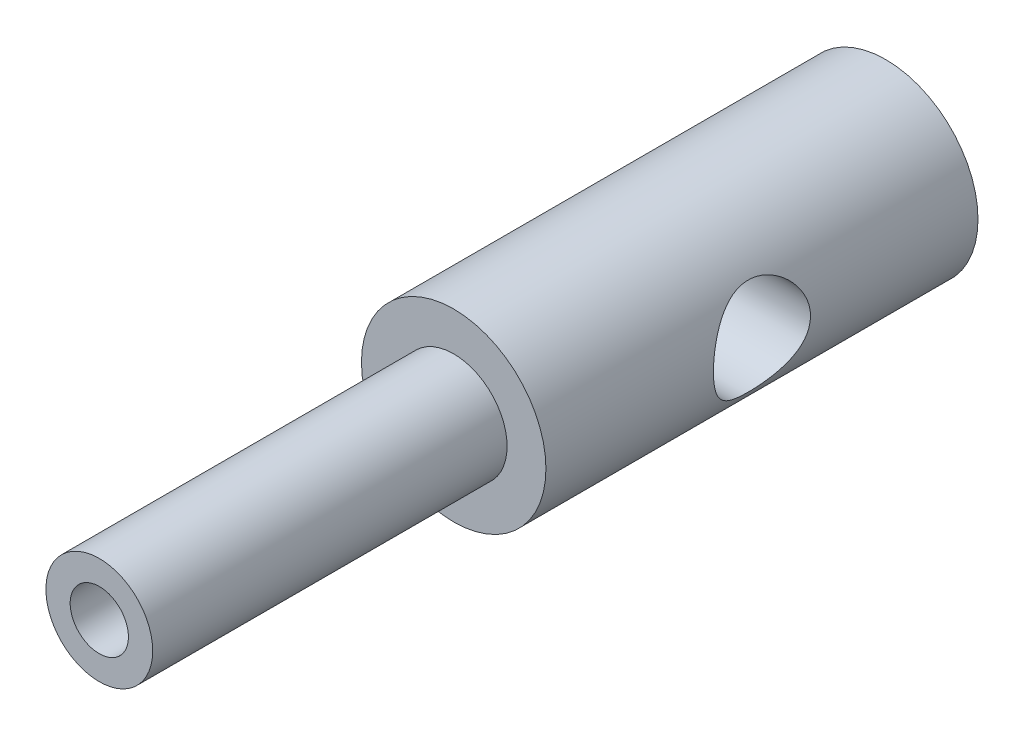
ISO-10303-21;
HEADER;
FILE_DESCRIPTION(('STEP AP214'),'2;1');
FILE_NAME('part.step','',(''),(''),'','','');
FILE_SCHEMA(('AUTOMOTIVE_DESIGN { 1 0 10303 214 1 1 1 1 }'));
ENDSEC;
DATA;
#1=APPLICATION_CONTEXT('core data for automotive mechanical design processes');
#2=APPLICATION_PROTOCOL_DEFINITION('international standard','automotive_design',2000,#1);
#3=PRODUCT_CONTEXT('',#1,'mechanical');
#4=PRODUCT('Part','Part','',(#3));
#5=PRODUCT_RELATED_PRODUCT_CATEGORY('part','',(#4));
#6=PRODUCT_DEFINITION_FORMATION('','',#4);
#7=PRODUCT_DEFINITION_CONTEXT('part definition',#1,'design');
#8=PRODUCT_DEFINITION('design','',#6,#7);
#9=PRODUCT_DEFINITION_SHAPE('','',#8);
#10=(LENGTH_UNIT() NAMED_UNIT(*) SI_UNIT(.MILLI.,.METRE.));
#11=(NAMED_UNIT(*) PLANE_ANGLE_UNIT() SI_UNIT($,.RADIAN.));
#12=(NAMED_UNIT(*) SI_UNIT($,.STERADIAN.) SOLID_ANGLE_UNIT());
#13=UNCERTAINTY_MEASURE_WITH_UNIT(LENGTH_MEASURE(1.E-05),#10,'distance_accuracy_value','');
#14=(GEOMETRIC_REPRESENTATION_CONTEXT(3) GLOBAL_UNCERTAINTY_ASSIGNED_CONTEXT((#13)) GLOBAL_UNIT_ASSIGNED_CONTEXT((#10,
#11,#12)) REPRESENTATION_CONTEXT('',''));
#15=CARTESIAN_POINT('',(0.,0.,0.));
#16=DIRECTION('',(0.,0.,1.));
#17=DIRECTION('',(1.,0.,0.));
#18=AXIS2_PLACEMENT_3D('',#15,#16,#17);
#19=CARTESIAN_POINT('',(0.,0.,36.6134723107493));
#20=DIRECTION('',(0.,0.,1.));
#21=DIRECTION('',(1.,0.,0.));
#22=AXIS2_PLACEMENT_3D('',#19,#20,#21);
#23=CYLINDRICAL_SURFACE('',#22,1.524);
#24=CARTESIAN_POINT('',(0.,0.,11.303));
#25=DIRECTION('',(0.,0.,1.));
#26=DIRECTION('',(1.,0.,0.));
#27=AXIS2_PLACEMENT_3D('',#24,#25,#26);
#28=CIRCLE('',#27,1.524);
#29=CARTESIAN_POINT('',(1.524,0.,11.303));
#30=VERTEX_POINT('',#29);
#31=EDGE_CURVE('E11',#30,#30,#28,.T.);
#32=ORIENTED_EDGE('',*,*,#31,.F.);
#33=EDGE_LOOP('',(#32));
#34=FACE_BOUND('',#33,.T.);
#35=CARTESIAN_POINT('',(0.,0.,29.845));
#36=DIRECTION('',(0.,0.,1.));
#37=DIRECTION('',(1.,0.,0.));
#38=AXIS2_PLACEMENT_3D('',#35,#36,#37);
#39=CIRCLE('',#38,1.524);
#40=CARTESIAN_POINT('',(1.524,0.,29.845));
#41=VERTEX_POINT('',#40);
#42=EDGE_CURVE('E64',#41,#41,#39,.T.);
#43=ORIENTED_EDGE('',*,*,#42,.T.);
#44=EDGE_LOOP('',(#43));
#45=FACE_BOUND('',#44,.T.);
#46=ADVANCED_FACE('F32',(#34,#45),#23,.F.);
#47=CARTESIAN_POINT('',(0.,1.524,11.303));
#48=DIRECTION('',(0.,0.,-1.));
#49=DIRECTION('',(-1.,0.,0.));
#50=AXIS2_PLACEMENT_3D('',#47,#48,#49);
#51=PLANE('',#50);
#52=ORIENTED_EDGE('',*,*,#31,.T.);
#53=EDGE_LOOP('',(#52));
#54=FACE_BOUND('',#53,.T.);
#55=ADVANCED_FACE('F44',(#54),#51,.F.);
#56=CARTESIAN_POINT('',(0.210398319920231,0.,-1.34864201962109));
#57=DIRECTION('',(0.,-1.,0.));
#58=DIRECTION('',(1.,0.,0.));
#59=AXIS2_PLACEMENT_3D('',#56,#57,#58);
#60=CIRCLE('',#59,10.9723753887063);
#61=TRIMMED_CURVE('',#60,(PARAMETER_VALUE(-1.58997277749052)),
(PARAMETER_VALUE(1.58997277749052)),.T.,.PARAMETER.);
#62=CARTESIAN_POINT('',(0.,0.,-1.34864201962109));
#63=DIRECTION('',(0.,0.,1.));
#64=AXIS1_PLACEMENT('',#62,#63);
#65=SURFACE_OF_REVOLUTION('',#61,#64);
#66=CARTESIAN_POINT('',(0.,0.,-11.303));
#67=DIRECTION('',(0.,0.,1.));
#68=DIRECTION('',(1.,0.,0.));
#69=AXIS2_PLACEMENT_3D('',#66,#67,#68);
#70=CIRCLE('',#69,4.826);
#71=CARTESIAN_POINT('',(4.826,0.,-11.303));
#72=VERTEX_POINT('',#71);
#73=EDGE_CURVE('E38',#72,#72,#70,.T.);
#74=ORIENTED_EDGE('',*,*,#73,.F.);
#75=EDGE_LOOP('',(#74));
#76=FACE_BOUND('',#75,.T.);
#77=CARTESIAN_POINT('',(0.,0.,-12.319));
#78=VERTEX_POINT('',#77);
#79=VERTEX_LOOP('',#78);
#80=FACE_BOUND('',#79,.T.);
#81=ADVANCED_FACE('F41',(#76,#80),#65,.T.);
#82=CARTESIAN_POINT('',(0.,0.,36.6134723107493));
#83=DIRECTION('',(0.,0.,1.));
#84=DIRECTION('',(1.,0.,0.));
#85=AXIS2_PLACEMENT_3D('',#82,#83,#84);
#86=CYLINDRICAL_SURFACE('',#85,4.826);
#87=CARTESIAN_POINT('',(-4.826,0.,-2.54));
#88=CARTESIAN_POINT('',(-4.82599108722361,0.132671727413436,-2.53998970239344));
#89=CARTESIAN_POINT('',(-4.82047125156288,0.265481968353217,-2.52954357726874));
#90=CARTESIAN_POINT('',(-4.79893032203788,0.527119821613084,-2.48824304450853));
#91=CARTESIAN_POINT('',(-4.78289216641369,0.655940606494487,-2.45735547808212));
#92=CARTESIAN_POINT('',(-4.7419816922442,0.905431289774782,-2.37674403171466));
#93=CARTESIAN_POINT('',(-4.71714487204603,1.02613165516498,-2.32709578912966));
#94=CARTESIAN_POINT('',(-4.66086863610746,1.25727953018631,-2.21079285628327));
#95=CARTESIAN_POINT('',(-4.62942930184638,1.36772716631853,-2.14413837588774));
#96=CARTESIAN_POINT('',(-4.56038023318126,1.5832989798215,-1.99082406976726));
#97=CARTESIAN_POINT('',(-4.52250238950114,1.68761176994581,-1.90314624917141));
#98=CARTESIAN_POINT('',(-4.44563295884892,1.88081258984201,-1.71247923080912));
#99=CARTESIAN_POINT('',(-4.4066404564786,1.96968749142896,-1.60947713830809));
#100=CARTESIAN_POINT('',(-4.32795611021071,2.1373780367139,-1.38026510829494));
#101=CARTESIAN_POINT('',(-4.28850606243428,2.21461446655133,-1.25280939787052));
#102=CARTESIAN_POINT('',(-4.2179379601073,2.34625321505091,-0.984350884530217));
#103=CARTESIAN_POINT('',(-4.18681355758633,2.40067294859597,-0.843358514883821));
#104=CARTESIAN_POINT('',(-4.15092654717635,2.46182491483836,-0.629364435915659));
#105=CARTESIAN_POINT('',(-4.14093754389936,2.47854123230209,-0.559963251692714));
#106=CARTESIAN_POINT('',(-4.1243090393974,2.50611551780559,-0.41962701740498));
#107=CARTESIAN_POINT('',(-4.11766766376968,2.51697676445226,-0.348692848945094));
#108=CARTESIAN_POINT('',(-4.10804505946568,2.53265234988395,-0.205965434651406));
#109=CARTESIAN_POINT('',(-4.1050610127179,2.53747134445475,-0.134172893344674));
#110=CARTESIAN_POINT('',(-4.10287559704393,2.54100092747068,0.00959608356973793));
#111=CARTESIAN_POINT('',(-4.10367379235338,2.539712219604,0.0815724970379407));
#112=CARTESIAN_POINT('',(-4.11099346238332,2.52787067626693,0.277161496402171));
#113=CARTESIAN_POINT('',(-4.12124856777439,2.51127256309405,0.400333711927561));
#114=CARTESIAN_POINT('',(-4.15163246424047,2.46070324540304,0.641710718396217));
#115=CARTESIAN_POINT('',(-4.1717650305969,2.42672539793513,0.759913591228928));
#116=CARTESIAN_POINT('',(-4.22001621717023,2.34182911069649,0.991456040571426));
#117=CARTESIAN_POINT('',(-4.24830604698801,2.29054297408753,1.10462387686321));
#118=CARTESIAN_POINT('',(-4.30972258399316,2.17277977330617,1.32130894809646));
#119=CARTESIAN_POINT('',(-4.34285144686724,2.10629593138129,1.42482184811691));
#120=CARTESIAN_POINT('',(-4.41590404440184,1.94900130669127,1.63479698245392));
#121=CARTESIAN_POINT('',(-4.45612325057126,1.85607382057027,1.73957678842223));
#122=CARTESIAN_POINT('',(-4.53504609144926,1.65390878409477,1.93280964630199));
#123=CARTESIAN_POINT('',(-4.57374883592344,1.54466182929683,2.0212532179472));
#124=CARTESIAN_POINT('',(-4.64793424817353,1.30519956619788,2.18407094319797));
#125=CARTESIAN_POINT('',(-4.68311075985481,1.17414752651852,2.25736570848074));
#126=CARTESIAN_POINT('',(-4.74355741798229,0.899262991981225,2.38023808097473));
#127=CARTESIAN_POINT('',(-4.7688361996899,0.755441772593108,2.4298363705033));
#128=CARTESIAN_POINT('',(-4.80471527813416,0.472722667108751,2.49948333378024));
#129=CARTESIAN_POINT('',(-4.81641616290188,0.334514568146813,2.52175772939615));
#130=CARTESIAN_POINT('',(-4.8276865625482,0.0558527783641373,2.54322137881605));
#131=CARTESIAN_POINT('',(-4.82726280425544,-0.0845996240720168,2.5424234332982));
#132=CARTESIAN_POINT('',(-4.81492800330122,-0.350603677123995,2.51891467385047));
#133=CARTESIAN_POINT('',(-4.80402920096687,-0.476380559113346,2.49813470503691));
#134=CARTESIAN_POINT('',(-4.77324084183485,-0.722369844174469,2.43840228679882));
#135=CARTESIAN_POINT('',(-4.75335033850668,-0.842581659958696,2.39944792419428));
#136=CARTESIAN_POINT('',(-4.70570362306431,-1.07768192077833,2.30363604311726));
#137=CARTESIAN_POINT('',(-4.67775740611376,-1.19235248320353,2.2463418336659));
#138=CARTESIAN_POINT('',(-4.61658115367783,-1.41079460303505,2.11599988396211));
#139=CARTESIAN_POINT('',(-4.58334900910351,-1.51456178242331,2.04294585136614));
#140=CARTESIAN_POINT('',(-4.51056899207539,-1.71992089838233,1.87428532218791));
#141=CARTESIAN_POINT('',(-4.47072488885432,-1.82012168188046,1.7771106683904));
#142=CARTESIAN_POINT('',(-4.39161535325803,-2.00349303005818,1.56749253156448));
#143=CARTESIAN_POINT('',(-4.35235045587152,-2.0866486657826,1.4550358058891));
#144=CARTESIAN_POINT('',(-4.27626873612259,-2.23863312746198,1.2092490958132));
#145=CARTESIAN_POINT('',(-4.23976290684386,-2.30622622810844,1.07504960341396));
#146=CARTESIAN_POINT('',(-4.17752001419265,-2.41716789962534,0.794695862482454));
#147=CARTESIAN_POINT('',(-4.15176786635105,-2.46055046020459,0.648558705838511));
#148=CARTESIAN_POINT('',(-4.11739808639077,-2.51760249387967,0.363675373489684));
#149=CARTESIAN_POINT('',(-4.10734939485993,-2.53376580050266,0.225606978035502));
#150=CARTESIAN_POINT('',(-4.10148663761561,-2.54325251426608,-0.0515809174025368));
#151=CARTESIAN_POINT('',(-4.1056637598048,-2.53659006067524,-0.190699713445184));
#152=CARTESIAN_POINT('',(-4.12620301378974,-2.50300230205977,-0.448951627509829));
#153=CARTESIAN_POINT('',(-4.14109936774955,-2.47851068736586,-0.568534724852922));
#154=CARTESIAN_POINT('',(-4.17949142848085,-2.41320402180758,-0.801694164588604));
#155=CARTESIAN_POINT('',(-4.20299020945348,-2.37238313495859,-0.915268342980242));
#156=CARTESIAN_POINT('',(-4.25779154310853,-2.27264506312202,-1.1414706890733));
#157=CARTESIAN_POINT('',(-4.28950382647725,-2.21271932272514,-1.25355163999133));
#158=CARTESIAN_POINT('',(-4.35659981236126,-2.07750163519703,-1.46681674545683));
#159=CARTESIAN_POINT('',(-4.39198548552193,-2.00220141903645,-1.56799499115046));
#160=CARTESIAN_POINT('',(-4.46834947534946,-1.82607748017308,-1.77131408918365));
#161=CARTESIAN_POINT('',(-4.50941880200115,-1.72315801129811,-1.87161677105064));
#162=CARTESIAN_POINT('',(-4.58813890577827,-1.50105472683695,-2.05404906399512));
#163=CARTESIAN_POINT('',(-4.6257875521105,-1.38186088782291,-2.13616739291605));
#164=CARTESIAN_POINT('',(-4.69446936096672,-1.12690740795523,-2.2811267123878));
#165=CARTESIAN_POINT('',(-4.72535358335465,-0.99086185289248,-2.34354494529409));
#166=CARTESIAN_POINT('',(-4.76324157534271,-0.779091866608896,-2.41872771659057));
#167=CARTESIAN_POINT('',(-4.77446007764587,-0.707266167684351,-2.4407064530313));
#168=CARTESIAN_POINT('',(-4.79377695581443,-0.56156955482265,-2.47828286621761));
#169=CARTESIAN_POINT('',(-4.80187710019156,-0.487699825671372,-2.49388416010818));
#170=CARTESIAN_POINT('',(-4.81413367707863,-0.345056283253462,-2.51739912695292));
#171=CARTESIAN_POINT('',(-4.81857144462222,-0.276396846858169,-2.52586263820205));
#172=CARTESIAN_POINT('',(-4.82450696018622,-0.138504200911834,-2.53716581529406));
#173=CARTESIAN_POINT('',(-4.82600465356692,-0.0692709807213348,-2.54000537661881));
#174=CARTESIAN_POINT('',(-4.826,0.,-2.54));
#175=B_SPLINE_CURVE_WITH_KNOTS('',3,(#87,#88,#89,#90,#91,#92,#93,#94,#95,#96,#97,#98,#99,#100,
#101,#102,#103,#104,#105,#106,#107,#108,#109,#110,#111,#112,#113,#114,#115,#116,#117,#118,#119,
#120,#121,#122,#123,#124,#125,#126,#127,#128,#129,#130,#131,#132,#133,#134,#135,#136,#137,#138,
#139,#140,#141,#142,#143,#144,#145,#146,#147,#148,#149,#150,#151,#152,#153,#154,#155,#156,#157,
#158,#159,#160,#161,#162,#163,#164,#165,#166,#167,#168,#169,#170,#171,#172,#173,#174),
.UNSPECIFIED.,.T.,.F.,(4,2,2,2,2,2,2,2,2,2,2,2,2,2,2,2,2,2,2,2,2,2,2,2,2,2,2,2,2,2,2,2,2,2,2,2,
2,2,2,2,2,2,2,4),(0.,0.397746322124852,0.796139429390454,1.19294318340143,1.58974204088334,
2.01230703227597,2.43522962684964,2.89546398653495,3.35534642925026,3.57131730828118,
3.78716712625361,4.0028505212892,4.21850906734589,4.59069978173493,4.96303286273313,
5.34383371635714,5.72480472900837,6.16007486603841,6.59559681142577,7.05576432470947,
7.51552946608198,7.93462648338877,8.35349098753117,8.73556505635372,9.11767935438354,
9.50966949331942,9.90181643076405,10.3354440624032,10.7694498781607,11.230852131371,
11.6916049716728,12.1072345058252,12.5226066275275,12.8899184507141,13.2573616664124,
13.6488257313868,14.0405008991967,14.4868650082089,14.9335052847162,15.3891646870736,
15.6167064519079,15.8441189803958,16.0517876850923,16.259460249165),.UNSPECIFIED.);
#176=CARTESIAN_POINT('',(-4.826,0.,-2.54));
#177=VERTEX_POINT('',#176);
#178=EDGE_CURVE('E67',#177,#177,#175,.T.);
#179=ORIENTED_EDGE('',*,*,#178,.T.);
#180=EDGE_LOOP('',(#179));
#181=FACE_BOUND('',#180,.T.);
#182=CARTESIAN_POINT('',(4.826,0.,-2.54));
#183=CARTESIAN_POINT('',(4.82599108722361,-0.132671727413436,-2.53998970239344));
#184=CARTESIAN_POINT('',(4.82047125156288,-0.265481968353217,-2.52954357726874));
#185=CARTESIAN_POINT('',(4.79893032203788,-0.527119821613084,-2.48824304450853));
#186=CARTESIAN_POINT('',(4.78289216641369,-0.655940606494487,-2.45735547808212));
#187=CARTESIAN_POINT('',(4.7419816922442,-0.905431289774781,-2.37674403171466));
#188=CARTESIAN_POINT('',(4.71714487204603,-1.02613165516498,-2.32709578912966));
#189=CARTESIAN_POINT('',(4.66086863610746,-1.25727953018631,-2.21079285628327));
#190=CARTESIAN_POINT('',(4.62942930184638,-1.36772716631853,-2.14413837588774));
#191=CARTESIAN_POINT('',(4.56038023318127,-1.58329897982149,-1.99082406976726));
#192=CARTESIAN_POINT('',(4.52250238950114,-1.68761176994581,-1.90314624917141));
#193=CARTESIAN_POINT('',(4.44563295884892,-1.88081258984201,-1.71247923080912));
#194=CARTESIAN_POINT('',(4.4066404564786,-1.96968749142896,-1.60947713830809));
#195=CARTESIAN_POINT('',(4.32795611021071,-2.1373780367139,-1.38026510829494));
#196=CARTESIAN_POINT('',(4.28850606243428,-2.21461446655133,-1.25280939787052));
#197=CARTESIAN_POINT('',(4.2179379601073,-2.34625321505091,-0.984350884530217));
#198=CARTESIAN_POINT('',(4.18681355758633,-2.40067294859597,-0.843358514883821));
#199=CARTESIAN_POINT('',(4.15092654717635,-2.46182491483836,-0.629364435915659));
#200=CARTESIAN_POINT('',(4.14093754389936,-2.47854123230209,-0.559963251692714));
#201=CARTESIAN_POINT('',(4.1243090393974,-2.50611551780559,-0.41962701740498));
#202=CARTESIAN_POINT('',(4.11766766376968,-2.51697676445226,-0.348692848945094));
#203=CARTESIAN_POINT('',(4.10804505946568,-2.53265234988395,-0.205965434651406));
#204=CARTESIAN_POINT('',(4.1050610127179,-2.53747134445475,-0.134172893344674));
#205=CARTESIAN_POINT('',(4.10287559704393,-2.54100092747068,0.00959608356973811));
#206=CARTESIAN_POINT('',(4.10367379235338,-2.539712219604,0.0815724970379407));
#207=CARTESIAN_POINT('',(4.11099346238332,-2.52787067626693,0.277161496402171));
#208=CARTESIAN_POINT('',(4.12124856777439,-2.51127256309405,0.400333711927561));
#209=CARTESIAN_POINT('',(4.15163246424047,-2.46070324540304,0.641710718396217));
#210=CARTESIAN_POINT('',(4.1717650305969,-2.42672539793513,0.759913591228928));
#211=CARTESIAN_POINT('',(4.22001621717023,-2.34182911069649,0.991456040571426));
#212=CARTESIAN_POINT('',(4.24830604698801,-2.29054297408753,1.10462387686321));
#213=CARTESIAN_POINT('',(4.30972258399316,-2.17277977330617,1.32130894809646));
#214=CARTESIAN_POINT('',(4.34285144686724,-2.10629593138129,1.42482184811691));
#215=CARTESIAN_POINT('',(4.41590404440184,-1.94900130669127,1.63479698245392));
#216=CARTESIAN_POINT('',(4.45612325057126,-1.85607382057027,1.73957678842222));
#217=CARTESIAN_POINT('',(4.53504609144926,-1.65390878409477,1.93280964630199));
#218=CARTESIAN_POINT('',(4.57374883592344,-1.54466182929683,2.0212532179472));
#219=CARTESIAN_POINT('',(4.64793424817353,-1.30519956619788,2.18407094319797));
#220=CARTESIAN_POINT('',(4.68311075985481,-1.17414752651852,2.25736570848074));
#221=CARTESIAN_POINT('',(4.74355741798229,-0.899262991981224,2.38023808097473));
#222=CARTESIAN_POINT('',(4.7688361996899,-0.755441772593108,2.4298363705033));
#223=CARTESIAN_POINT('',(4.80471527813416,-0.47272266710875,2.49948333378024));
#224=CARTESIAN_POINT('',(4.81641616290188,-0.334514568146813,2.52175772939615));
#225=CARTESIAN_POINT('',(4.8276865625482,-0.0558527783641363,2.54322137881605));
#226=CARTESIAN_POINT('',(4.82726280425544,0.0845996240720178,2.5424234332982));
#227=CARTESIAN_POINT('',(4.81492800330122,0.350603677123996,2.51891467385046));
#228=CARTESIAN_POINT('',(4.80402920096687,0.476380559113348,2.49813470503691));
#229=CARTESIAN_POINT('',(4.77324084183485,0.72236984417447,2.43840228679882));
#230=CARTESIAN_POINT('',(4.75335033850668,0.842581659958697,2.39944792419428));
#231=CARTESIAN_POINT('',(4.70570362306431,1.07768192077834,2.30363604311726));
#232=CARTESIAN_POINT('',(4.67775740611376,1.19235248320353,2.2463418336659));
#233=CARTESIAN_POINT('',(4.61658115367783,1.41079460303505,2.11599988396211));
#234=CARTESIAN_POINT('',(4.58334900910351,1.51456178242331,2.04294585136613));
#235=CARTESIAN_POINT('',(4.51056899207539,1.71992089838233,1.87428532218791));
#236=CARTESIAN_POINT('',(4.47072488885432,1.82012168188046,1.7771106683904));
#237=CARTESIAN_POINT('',(4.39161535325803,2.00349303005818,1.56749253156448));
#238=CARTESIAN_POINT('',(4.35235045587152,2.0866486657826,1.4550358058891));
#239=CARTESIAN_POINT('',(4.27626873612259,2.23863312746198,1.20924909581319));
#240=CARTESIAN_POINT('',(4.23976290684386,2.30622622810844,1.07504960341396));
#241=CARTESIAN_POINT('',(4.17752001419265,2.41716789962534,0.794695862482452));
#242=CARTESIAN_POINT('',(4.15176786635105,2.46055046020459,0.648558705838509));
#243=CARTESIAN_POINT('',(4.11739808639077,2.51760249387967,0.363675373489683));
#244=CARTESIAN_POINT('',(4.10734939485993,2.53376580050266,0.225606978035502));
#245=CARTESIAN_POINT('',(4.10148663761561,2.54325251426608,-0.0515809174025368));
#246=CARTESIAN_POINT('',(4.1056637598048,2.53659006067524,-0.190699713445184));
#247=CARTESIAN_POINT('',(4.12620301378974,2.50300230205977,-0.448951627509829));
#248=CARTESIAN_POINT('',(4.14109936774955,2.47851068736586,-0.568534724852922));
#249=CARTESIAN_POINT('',(4.17949142848085,2.41320402180758,-0.801694164588605));
#250=CARTESIAN_POINT('',(4.20299020945348,2.37238313495858,-0.915268342980242));
#251=CARTESIAN_POINT('',(4.25779154310853,2.27264506312202,-1.1414706890733));
#252=CARTESIAN_POINT('',(4.28950382647725,2.21271932272514,-1.25355163999133));
#253=CARTESIAN_POINT('',(4.35659981236126,2.07750163519703,-1.46681674545683));
#254=CARTESIAN_POINT('',(4.39198548552193,2.00220141903645,-1.56799499115046));
#255=CARTESIAN_POINT('',(4.46834947534946,1.82607748017308,-1.77131408918365));
#256=CARTESIAN_POINT('',(4.50941880200115,1.72315801129811,-1.87161677105064));
#257=CARTESIAN_POINT('',(4.58813890577827,1.50105472683695,-2.05404906399512));
#258=CARTESIAN_POINT('',(4.6257875521105,1.38186088782291,-2.13616739291605));
#259=CARTESIAN_POINT('',(4.69446936096672,1.12690740795523,-2.2811267123878));
#260=CARTESIAN_POINT('',(4.72535358335465,0.99086185289248,-2.34354494529409));
#261=CARTESIAN_POINT('',(4.76324157534271,0.779091866608896,-2.41872771659057));
#262=CARTESIAN_POINT('',(4.77446007764587,0.707266167684351,-2.4407064530313));
#263=CARTESIAN_POINT('',(4.79377695581443,0.561569554822649,-2.47828286621761));
#264=CARTESIAN_POINT('',(4.80187710019156,0.487699825671372,-2.49388416010818));
#265=CARTESIAN_POINT('',(4.81413367707863,0.34505628325346,-2.51739912695292));
#266=CARTESIAN_POINT('',(4.81857144462222,0.276396846858167,-2.52586263820205));
#267=CARTESIAN_POINT('',(4.82450696018622,0.138504200911831,-2.53716581529406));
#268=CARTESIAN_POINT('',(4.82600465356692,0.0692709807213336,-2.54000537661881));
#269=CARTESIAN_POINT('',(4.826,0.,-2.54));
#270=B_SPLINE_CURVE_WITH_KNOTS('',3,(#182,#183,#184,#185,#186,#187,#188,#189,#190,#191,#192,
#193,#194,#195,#196,#197,#198,#199,#200,#201,#202,#203,#204,#205,#206,#207,#208,#209,#210,#211,
#212,#213,#214,#215,#216,#217,#218,#219,#220,#221,#222,#223,#224,#225,#226,#227,#228,#229,#230,
#231,#232,#233,#234,#235,#236,#237,#238,#239,#240,#241,#242,#243,#244,#245,#246,#247,#248,#249,
#250,#251,#252,#253,#254,#255,#256,#257,#258,#259,#260,#261,#262,#263,#264,#265,#266,#267,#268,
#269),.UNSPECIFIED.,.T.,.F.,(4,2,2,2,2,2,2,2,2,2,2,2,2,2,2,2,2,2,2,2,2,2,2,2,2,2,2,2,2,2,2,2,2,
2,2,2,2,2,2,2,2,2,2,4),(0.,0.397746322124852,0.796139429390453,1.19294318340143,
1.58974204088334,2.01230703227597,2.43522962684964,2.89546398653495,3.35534642925026,
3.57131730828118,3.78716712625361,4.0028505212892,4.21850906734589,4.59069978173493,
4.96303286273313,5.34383371635714,5.72480472900837,6.16007486603842,6.59559681142577,
7.05576432470948,7.51552946608198,7.93462648338878,8.35349098753117,8.73556505635372,
9.11767935438354,9.50966949331942,9.90181643076405,10.3354440624032,10.7694498781607,
11.230852131371,11.6916049716728,12.1072345058253,12.5226066275275,12.8899184507141,
13.2573616664124,13.6488257313868,14.0405008991967,14.4868650082089,14.9335052847162,
15.3891646870736,15.6167064519079,15.8441189803958,16.0517876850923,16.259460249165),.UNSPECIFIED.);
#271=CARTESIAN_POINT('',(4.826,0.,-2.54));
#272=VERTEX_POINT('',#271);
#273=EDGE_CURVE('E73',#272,#272,#270,.T.);
#274=ORIENTED_EDGE('',*,*,#273,.T.);
#275=EDGE_LOOP('',(#274));
#276=FACE_BOUND('',#275,.T.);
#277=CARTESIAN_POINT('',(0.,0.,11.303));
#278=DIRECTION('',(0.,0.,1.));
#279=DIRECTION('',(1.,0.,0.));
#280=AXIS2_PLACEMENT_3D('',#277,#278,#279);
#281=CIRCLE('',#280,4.826);
#282=CARTESIAN_POINT('',(4.826,0.,11.303));
#283=VERTEX_POINT('',#282);
#284=EDGE_CURVE('E82',#283,#283,#281,.T.);
#285=ORIENTED_EDGE('',*,*,#284,.F.);
#286=EDGE_LOOP('',(#285));
#287=FACE_BOUND('',#286,.T.);
#288=ORIENTED_EDGE('',*,*,#73,.T.);
#289=EDGE_LOOP('',(#288));
#290=FACE_BOUND('',#289,.T.);
#291=ADVANCED_FACE('F43',(#181,#276,#287,#290),#86,.T.);
#292=CARTESIAN_POINT('',(0.,4.826,11.303));
#293=DIRECTION('',(0.,0.,-1.));
#294=DIRECTION('',(-1.,0.,0.));
#295=AXIS2_PLACEMENT_3D('',#292,#293,#294);
#296=PLANE('',#295);
#297=CARTESIAN_POINT('',(0.,0.,11.303));
#298=DIRECTION('',(0.,0.,1.));
#299=DIRECTION('',(1.,0.,0.));
#300=AXIS2_PLACEMENT_3D('',#297,#298,#299);
#301=CIRCLE('',#300,2.794);
#302=CARTESIAN_POINT('',(2.794,0.,11.303));
#303=VERTEX_POINT('',#302);
#304=EDGE_CURVE('E70',#303,#303,#301,.T.);
#305=ORIENTED_EDGE('',*,*,#304,.F.);
#306=EDGE_LOOP('',(#305));
#307=FACE_BOUND('',#306,.T.);
#308=ORIENTED_EDGE('',*,*,#284,.T.);
#309=EDGE_LOOP('',(#308));
#310=FACE_BOUND('',#309,.T.);
#311=ADVANCED_FACE('F51',(#307,#310),#296,.F.);
#312=CARTESIAN_POINT('',(0.,0.,36.6134723107493));
#313=DIRECTION('',(0.,0.,1.));
#314=DIRECTION('',(1.,0.,0.));
#315=AXIS2_PLACEMENT_3D('',#312,#313,#314);
#316=CYLINDRICAL_SURFACE('',#315,2.794);
#317=CARTESIAN_POINT('',(0.,0.,29.845));
#318=DIRECTION('',(0.,0.,1.));
#319=DIRECTION('',(1.,0.,0.));
#320=AXIS2_PLACEMENT_3D('',#317,#318,#319);
#321=CIRCLE('',#320,2.794);
#322=CARTESIAN_POINT('',(2.794,0.,29.845));
#323=VERTEX_POINT('',#322);
#324=EDGE_CURVE('E66',#323,#323,#321,.T.);
#325=ORIENTED_EDGE('',*,*,#324,.F.);
#326=EDGE_LOOP('',(#325));
#327=FACE_BOUND('',#326,.T.);
#328=ORIENTED_EDGE('',*,*,#304,.T.);
#329=EDGE_LOOP('',(#328));
#330=FACE_BOUND('',#329,.T.);
#331=ADVANCED_FACE('F90',(#327,#330),#316,.T.);
#332=CARTESIAN_POINT('',(0.,2.794,29.845));
#333=DIRECTION('',(0.,0.,-1.));
#334=DIRECTION('',(-1.,0.,0.));
#335=AXIS2_PLACEMENT_3D('',#332,#333,#334);
#336=PLANE('',#335);
#337=ORIENTED_EDGE('',*,*,#42,.F.);
#338=EDGE_LOOP('',(#337));
#339=FACE_BOUND('',#338,.T.);
#340=ORIENTED_EDGE('',*,*,#324,.T.);
#341=EDGE_LOOP('',(#340));
#342=FACE_BOUND('',#341,.T.);
#343=ADVANCED_FACE('F96',(#339,#342),#336,.F.);
#344=CARTESIAN_POINT('',(-4.826,0.,0.));
#345=DIRECTION('',(1.,0.,0.));
#346=DIRECTION('',(0.,0.,-1.));
#347=AXIS2_PLACEMENT_3D('',#344,#345,#346);
#348=CYLINDRICAL_SURFACE('',#347,2.54);
#349=ORIENTED_EDGE('',*,*,#178,.F.);
#350=EDGE_LOOP('',(#349));
#351=FACE_BOUND('',#350,.T.);
#352=ORIENTED_EDGE('',*,*,#273,.F.);
#353=EDGE_LOOP('',(#352));
#354=FACE_BOUND('',#353,.T.);
#355=ADVANCED_FACE('F106',(#351,#354),#348,.F.);
#356=CLOSED_SHELL('',(#46,#55,#81,#291,#311,#331,#343,#355));
#357=MANIFOLD_SOLID_BREP('B2',#356);
#358=ADVANCED_BREP_SHAPE_REPRESENTATION('',(#18,#357),#14);
#359=SHAPE_DEFINITION_REPRESENTATION(#9,#358);
ENDSEC;
END-ISO-10303-21;
